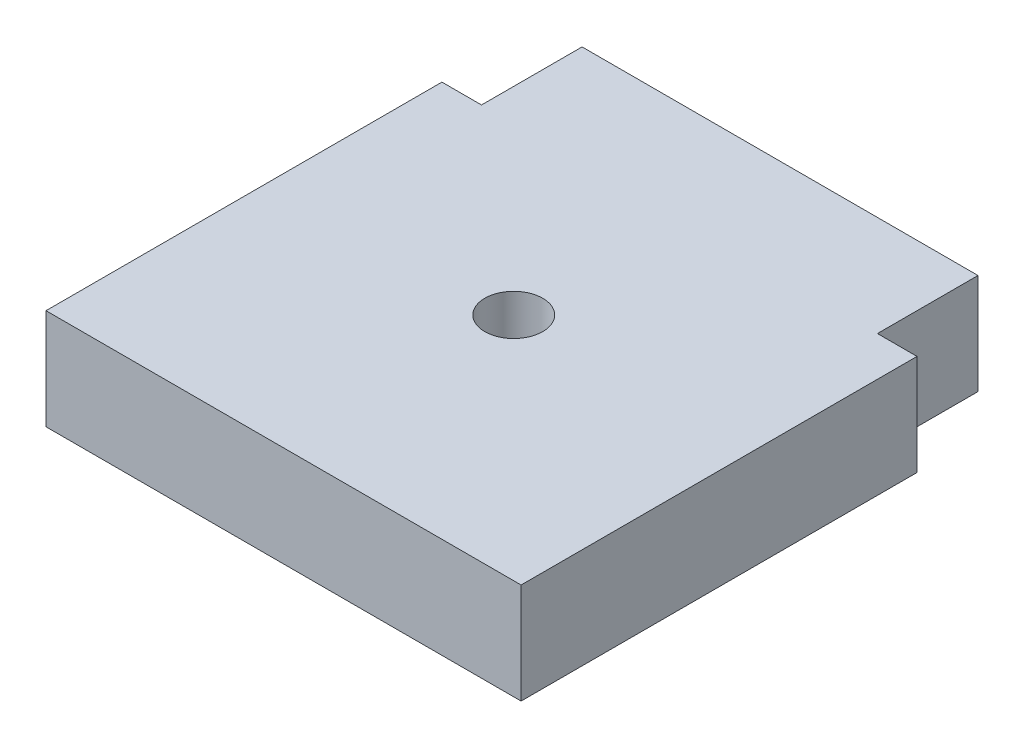
ISO-10303-21;
HEADER;
FILE_DESCRIPTION(('STEP AP214'),'2;1');
FILE_NAME('part.step','',(''),(''),'','','');
FILE_SCHEMA(('AUTOMOTIVE_DESIGN { 1 0 10303 214 1 1 1 1 }'));
ENDSEC;
DATA;
#1=APPLICATION_CONTEXT('core data for automotive mechanical design processes');
#2=APPLICATION_PROTOCOL_DEFINITION('international standard','automotive_design',2000,#1);
#3=PRODUCT_CONTEXT('',#1,'mechanical');
#4=PRODUCT('Part','Part','',(#3));
#5=PRODUCT_RELATED_PRODUCT_CATEGORY('part','',(#4));
#6=PRODUCT_DEFINITION_FORMATION('','',#4);
#7=PRODUCT_DEFINITION_CONTEXT('part definition',#1,'design');
#8=PRODUCT_DEFINITION('design','',#6,#7);
#9=PRODUCT_DEFINITION_SHAPE('','',#8);
#10=(LENGTH_UNIT() NAMED_UNIT(*) SI_UNIT(.MILLI.,.METRE.));
#11=(NAMED_UNIT(*) PLANE_ANGLE_UNIT() SI_UNIT($,.RADIAN.));
#12=(NAMED_UNIT(*) SI_UNIT($,.STERADIAN.) SOLID_ANGLE_UNIT());
#13=UNCERTAINTY_MEASURE_WITH_UNIT(LENGTH_MEASURE(1.E-05),#10,'distance_accuracy_value','');
#14=(GEOMETRIC_REPRESENTATION_CONTEXT(3) GLOBAL_UNCERTAINTY_ASSIGNED_CONTEXT((#13)) GLOBAL_UNIT_ASSIGNED_CONTEXT((#10,
#11,#12)) REPRESENTATION_CONTEXT('',''));
#15=CARTESIAN_POINT('',(0.,0.,0.));
#16=DIRECTION('',(0.,0.,1.));
#17=DIRECTION('',(1.,0.,0.));
#18=AXIS2_PLACEMENT_3D('',#15,#16,#17);
#19=CARTESIAN_POINT('',(-15.,6.35,12.5));
#20=DIRECTION('',(1.,0.,0.));
#21=DIRECTION('',(0.,0.,-1.));
#22=AXIS2_PLACEMENT_3D('',#19,#20,#21);
#23=PLANE('',#22);
#24=DIRECTION('',(0.,0.,1.));
#25=VECTOR('',#24,1.);
#26=CARTESIAN_POINT('',(-15.,0.,12.5));
#27=LINE('',#26,#25);
#28=CARTESIAN_POINT('',(-15.,0.,-12.5));
#29=VERTEX_POINT('',#28);
#30=CARTESIAN_POINT('',(-15.,0.,12.5));
#31=VERTEX_POINT('',#30);
#32=EDGE_CURVE('E129',#29,#31,#27,.T.);
#33=ORIENTED_EDGE('',*,*,#32,.T.);
#34=DIRECTION('',(0.,-1.,0.));
#35=VECTOR('',#34,1.);
#36=CARTESIAN_POINT('',(-15.,6.35,12.5));
#37=LINE('',#36,#35);
#38=CARTESIAN_POINT('',(-15.,6.35,12.5));
#39=VERTEX_POINT('',#38);
#40=EDGE_CURVE('E11',#39,#31,#37,.T.);
#41=ORIENTED_EDGE('',*,*,#40,.F.);
#42=DIRECTION('',(0.,0.,1.));
#43=VECTOR('',#42,1.);
#44=CARTESIAN_POINT('',(-15.,6.35,12.5));
#45=LINE('',#44,#43);
#46=CARTESIAN_POINT('',(-15.,6.35,-12.5));
#47=VERTEX_POINT('',#46);
#48=EDGE_CURVE('E144',#47,#39,#45,.T.);
#49=ORIENTED_EDGE('',*,*,#48,.F.);
#50=DIRECTION('',(0.,-1.,0.));
#51=VECTOR('',#50,1.);
#52=CARTESIAN_POINT('',(-15.,6.35,-12.5));
#53=LINE('',#52,#51);
#54=EDGE_CURVE('E125',#47,#29,#53,.T.);
#55=ORIENTED_EDGE('',*,*,#54,.T.);
#56=EDGE_LOOP('',(#33,#41,#49,#55));
#57=FACE_BOUND('',#56,.T.);
#58=ADVANCED_FACE('F33',(#57),#23,.F.);
#59=CARTESIAN_POINT('',(15.,6.35,12.5));
#60=DIRECTION('',(0.,0.,-1.));
#61=DIRECTION('',(-1.,0.,0.));
#62=AXIS2_PLACEMENT_3D('',#59,#60,#61);
#63=PLANE('',#62);
#64=DIRECTION('',(1.,0.,0.));
#65=VECTOR('',#64,1.);
#66=CARTESIAN_POINT('',(15.,0.,12.5));
#67=LINE('',#66,#65);
#68=CARTESIAN_POINT('',(15.,0.,12.5));
#69=VERTEX_POINT('',#68);
#70=EDGE_CURVE('E132',#31,#69,#67,.T.);
#71=ORIENTED_EDGE('',*,*,#70,.T.);
#72=DIRECTION('',(0.,-1.,0.));
#73=VECTOR('',#72,1.);
#74=CARTESIAN_POINT('',(15.,6.35,12.5));
#75=LINE('',#74,#73);
#76=CARTESIAN_POINT('',(15.,6.35,12.5));
#77=VERTEX_POINT('',#76);
#78=EDGE_CURVE('E41',#77,#69,#75,.T.);
#79=ORIENTED_EDGE('',*,*,#78,.F.);
#80=DIRECTION('',(1.,0.,0.));
#81=VECTOR('',#80,1.);
#82=CARTESIAN_POINT('',(15.,6.35,12.5));
#83=LINE('',#82,#81);
#84=EDGE_CURVE('E92',#39,#77,#83,.T.);
#85=ORIENTED_EDGE('',*,*,#84,.F.);
#86=ORIENTED_EDGE('',*,*,#40,.T.);
#87=EDGE_LOOP('',(#71,#79,#85,#86));
#88=FACE_BOUND('',#87,.T.);
#89=ADVANCED_FACE('F197',(#88),#63,.F.);
#90=CARTESIAN_POINT('',(15.,6.35,12.5));
#91=DIRECTION('',(-1.,0.,0.));
#92=DIRECTION('',(0.,0.,1.));
#93=AXIS2_PLACEMENT_3D('',#90,#91,#92);
#94=PLANE('',#93);
#95=DIRECTION('',(0.,0.,-1.));
#96=VECTOR('',#95,1.);
#97=CARTESIAN_POINT('',(15.,0.,12.5));
#98=LINE('',#97,#96);
#99=CARTESIAN_POINT('',(15.,0.,-12.5));
#100=VERTEX_POINT('',#99);
#101=EDGE_CURVE('E135',#69,#100,#98,.T.);
#102=ORIENTED_EDGE('',*,*,#101,.T.);
#103=DIRECTION('',(0.,-1.,0.));
#104=VECTOR('',#103,1.);
#105=CARTESIAN_POINT('',(15.,6.35,-12.5));
#106=LINE('',#105,#104);
#107=CARTESIAN_POINT('',(15.,6.35,-12.5));
#108=VERTEX_POINT('',#107);
#109=EDGE_CURVE('E151',#108,#100,#106,.T.);
#110=ORIENTED_EDGE('',*,*,#109,.F.);
#111=DIRECTION('',(0.,0.,-1.));
#112=VECTOR('',#111,1.);
#113=CARTESIAN_POINT('',(15.,6.35,12.5));
#114=LINE('',#113,#112);
#115=EDGE_CURVE('E159',#77,#108,#114,.T.);
#116=ORIENTED_EDGE('',*,*,#115,.F.);
#117=ORIENTED_EDGE('',*,*,#78,.T.);
#118=EDGE_LOOP('',(#102,#110,#116,#117));
#119=FACE_BOUND('',#118,.T.);
#120=ADVANCED_FACE('F157',(#119),#94,.F.);
#121=CARTESIAN_POINT('',(15.,6.35,-12.5));
#122=DIRECTION('',(0.,0.,1.));
#123=DIRECTION('',(1.,0.,0.));
#124=AXIS2_PLACEMENT_3D('',#121,#122,#123);
#125=PLANE('',#124);
#126=DIRECTION('',(-1.,0.,0.));
#127=VECTOR('',#126,1.);
#128=CARTESIAN_POINT('',(15.,0.,-12.5));
#129=LINE('',#128,#127);
#130=CARTESIAN_POINT('',(12.5,0.,-12.5));
#131=VERTEX_POINT('',#130);
#132=EDGE_CURVE('E137',#100,#131,#129,.T.);
#133=ORIENTED_EDGE('',*,*,#132,.T.);
#134=DIRECTION('',(0.,-1.,0.));
#135=VECTOR('',#134,1.);
#136=CARTESIAN_POINT('',(12.5,6.35,-12.5));
#137=LINE('',#136,#135);
#138=CARTESIAN_POINT('',(12.5,6.35,-12.5));
#139=VERTEX_POINT('',#138);
#140=EDGE_CURVE('E148',#139,#131,#137,.T.);
#141=ORIENTED_EDGE('',*,*,#140,.F.);
#142=DIRECTION('',(-1.,0.,0.));
#143=VECTOR('',#142,1.);
#144=CARTESIAN_POINT('',(15.,6.35,-12.5));
#145=LINE('',#144,#143);
#146=EDGE_CURVE('E171',#108,#139,#145,.T.);
#147=ORIENTED_EDGE('',*,*,#146,.F.);
#148=ORIENTED_EDGE('',*,*,#109,.T.);
#149=EDGE_LOOP('',(#133,#141,#147,#148));
#150=FACE_BOUND('',#149,.T.);
#151=ADVANCED_FACE('F167',(#150),#125,.F.);
#152=CARTESIAN_POINT('',(12.5,6.35,-18.85));
#153=DIRECTION('',(-1.,0.,0.));
#154=DIRECTION('',(0.,0.,1.));
#155=AXIS2_PLACEMENT_3D('',#152,#153,#154);
#156=PLANE('',#155);
#157=DIRECTION('',(0.,0.,-1.));
#158=VECTOR('',#157,1.);
#159=CARTESIAN_POINT('',(12.5,0.,-18.85));
#160=LINE('',#159,#158);
#161=CARTESIAN_POINT('',(12.5,0.,-18.85));
#162=VERTEX_POINT('',#161);
#163=EDGE_CURVE('E139',#131,#162,#160,.T.);
#164=ORIENTED_EDGE('',*,*,#163,.T.);
#165=DIRECTION('',(0.,-1.,0.));
#166=VECTOR('',#165,1.);
#167=CARTESIAN_POINT('',(12.5,6.35,-18.85));
#168=LINE('',#167,#166);
#169=CARTESIAN_POINT('',(12.5,6.35,-18.85));
#170=VERTEX_POINT('',#169);
#171=EDGE_CURVE('E120',#170,#162,#168,.T.);
#172=ORIENTED_EDGE('',*,*,#171,.F.);
#173=DIRECTION('',(0.,0.,-1.));
#174=VECTOR('',#173,1.);
#175=CARTESIAN_POINT('',(12.5,6.35,-18.85));
#176=LINE('',#175,#174);
#177=EDGE_CURVE('E111',#139,#170,#176,.T.);
#178=ORIENTED_EDGE('',*,*,#177,.F.);
#179=ORIENTED_EDGE('',*,*,#140,.T.);
#180=EDGE_LOOP('',(#164,#172,#178,#179));
#181=FACE_BOUND('',#180,.T.);
#182=ADVANCED_FACE('F170',(#181),#156,.F.);
#183=CARTESIAN_POINT('',(-12.5,6.35,-18.85));
#184=DIRECTION('',(0.,0.,1.));
#185=DIRECTION('',(1.,0.,0.));
#186=AXIS2_PLACEMENT_3D('',#183,#184,#185);
#187=PLANE('',#186);
#188=DIRECTION('',(-1.,0.,0.));
#189=VECTOR('',#188,1.);
#190=CARTESIAN_POINT('',(-12.5,0.,-18.85));
#191=LINE('',#190,#189);
#192=CARTESIAN_POINT('',(-12.5,0.,-18.85));
#193=VERTEX_POINT('',#192);
#194=EDGE_CURVE('E119',#162,#193,#191,.T.);
#195=ORIENTED_EDGE('',*,*,#194,.T.);
#196=DIRECTION('',(0.,-1.,0.));
#197=VECTOR('',#196,1.);
#198=CARTESIAN_POINT('',(-12.5,6.35,-18.85));
#199=LINE('',#198,#197);
#200=CARTESIAN_POINT('',(-12.5,6.35,-18.85));
#201=VERTEX_POINT('',#200);
#202=EDGE_CURVE('E116',#201,#193,#199,.T.);
#203=ORIENTED_EDGE('',*,*,#202,.F.);
#204=DIRECTION('',(-1.,0.,0.));
#205=VECTOR('',#204,1.);
#206=CARTESIAN_POINT('',(-12.5,6.35,-18.85));
#207=LINE('',#206,#205);
#208=EDGE_CURVE('E105',#170,#201,#207,.T.);
#209=ORIENTED_EDGE('',*,*,#208,.F.);
#210=ORIENTED_EDGE('',*,*,#171,.T.);
#211=EDGE_LOOP('',(#195,#203,#209,#210));
#212=FACE_BOUND('',#211,.T.);
#213=ADVANCED_FACE('F117',(#212),#187,.F.);
#214=CARTESIAN_POINT('',(-12.5,6.35,-18.85));
#215=DIRECTION('',(1.,0.,0.));
#216=DIRECTION('',(0.,0.,-1.));
#217=AXIS2_PLACEMENT_3D('',#214,#215,#216);
#218=PLANE('',#217);
#219=DIRECTION('',(0.,0.,1.));
#220=VECTOR('',#219,1.);
#221=CARTESIAN_POINT('',(-12.5,0.,-18.85));
#222=LINE('',#221,#220);
#223=CARTESIAN_POINT('',(-12.5,0.,-12.5));
#224=VERTEX_POINT('',#223);
#225=EDGE_CURVE('E78',#193,#224,#222,.T.);
#226=ORIENTED_EDGE('',*,*,#225,.T.);
#227=DIRECTION('',(0.,-1.,0.));
#228=VECTOR('',#227,1.);
#229=CARTESIAN_POINT('',(-12.5,6.35,-12.5));
#230=LINE('',#229,#228);
#231=CARTESIAN_POINT('',(-12.5,6.35,-12.5));
#232=VERTEX_POINT('',#231);
#233=EDGE_CURVE('E121',#232,#224,#230,.T.);
#234=ORIENTED_EDGE('',*,*,#233,.F.);
#235=DIRECTION('',(0.,0.,1.));
#236=VECTOR('',#235,1.);
#237=CARTESIAN_POINT('',(-12.5,6.35,-18.85));
#238=LINE('',#237,#236);
#239=EDGE_CURVE('E109',#201,#232,#238,.T.);
#240=ORIENTED_EDGE('',*,*,#239,.F.);
#241=ORIENTED_EDGE('',*,*,#202,.T.);
#242=EDGE_LOOP('',(#226,#234,#240,#241));
#243=FACE_BOUND('',#242,.T.);
#244=ADVANCED_FACE('F123',(#243),#218,.F.);
#245=CARTESIAN_POINT('',(-12.5,6.35,-12.5));
#246=DIRECTION('',(0.,0.,1.));
#247=DIRECTION('',(1.,0.,0.));
#248=AXIS2_PLACEMENT_3D('',#245,#246,#247);
#249=PLANE('',#248);
#250=DIRECTION('',(-1.,0.,0.));
#251=VECTOR('',#250,1.);
#252=CARTESIAN_POINT('',(-12.5,0.,-12.5));
#253=LINE('',#252,#251);
#254=EDGE_CURVE('E84',#224,#29,#253,.T.);
#255=ORIENTED_EDGE('',*,*,#254,.T.);
#256=ORIENTED_EDGE('',*,*,#54,.F.);
#257=DIRECTION('',(-1.,0.,0.));
#258=VECTOR('',#257,1.);
#259=CARTESIAN_POINT('',(-12.5,6.35,-12.5));
#260=LINE('',#259,#258);
#261=EDGE_CURVE('E49',#232,#47,#260,.T.);
#262=ORIENTED_EDGE('',*,*,#261,.F.);
#263=ORIENTED_EDGE('',*,*,#233,.T.);
#264=EDGE_LOOP('',(#255,#256,#262,#263));
#265=FACE_BOUND('',#264,.T.);
#266=ADVANCED_FACE('F186',(#265),#249,.F.);
#267=CARTESIAN_POINT('',(0.,6.35,0.));
#268=DIRECTION('',(0.,1.,0.));
#269=DIRECTION('',(0.,0.,1.));
#270=AXIS2_PLACEMENT_3D('',#267,#268,#269);
#271=PLANE('',#270);
#272=CARTESIAN_POINT('',(0.,6.35,-2.0352));
#273=DIRECTION('',(0.,1.,0.));
#274=DIRECTION('',(0.,0.,1.));
#275=AXIS2_PLACEMENT_3D('',#272,#273,#274);
#276=CIRCLE('',#275,1.82879999999999);
#277=CARTESIAN_POINT('',(0.,6.35,-0.206400000000011));
#278=VERTEX_POINT('',#277);
#279=EDGE_CURVE('E179',#278,#278,#276,.T.);
#280=ORIENTED_EDGE('',*,*,#279,.F.);
#281=EDGE_LOOP('',(#280));
#282=FACE_BOUND('',#281,.T.);
#283=ORIENTED_EDGE('',*,*,#48,.T.);
#284=ORIENTED_EDGE('',*,*,#84,.T.);
#285=ORIENTED_EDGE('',*,*,#115,.T.);
#286=ORIENTED_EDGE('',*,*,#146,.T.);
#287=ORIENTED_EDGE('',*,*,#177,.T.);
#288=ORIENTED_EDGE('',*,*,#208,.T.);
#289=ORIENTED_EDGE('',*,*,#239,.T.);
#290=ORIENTED_EDGE('',*,*,#261,.T.);
#291=EDGE_LOOP('',(#283,#284,#285,#286,#287,#288,#289,#290));
#292=FACE_BOUND('',#291,.T.);
#293=ADVANCED_FACE('F107',(#282,#292),#271,.T.);
#294=CARTESIAN_POINT('',(0.,0.,0.));
#295=DIRECTION('',(0.,1.,0.));
#296=DIRECTION('',(0.,0.,1.));
#297=AXIS2_PLACEMENT_3D('',#294,#295,#296);
#298=PLANE('',#297);
#299=CARTESIAN_POINT('',(0.,0.,-2.0352));
#300=DIRECTION('',(0.,1.,0.));
#301=DIRECTION('',(0.,0.,1.));
#302=AXIS2_PLACEMENT_3D('',#299,#300,#301);
#303=CIRCLE('',#302,1.8288);
#304=CARTESIAN_POINT('',(0.,0.,-0.2064));
#305=VERTEX_POINT('',#304);
#306=EDGE_CURVE('E133',#305,#305,#303,.T.);
#307=ORIENTED_EDGE('',*,*,#306,.T.);
#308=EDGE_LOOP('',(#307));
#309=FACE_BOUND('',#308,.T.);
#310=ORIENTED_EDGE('',*,*,#32,.F.);
#311=ORIENTED_EDGE('',*,*,#254,.F.);
#312=ORIENTED_EDGE('',*,*,#225,.F.);
#313=ORIENTED_EDGE('',*,*,#194,.F.);
#314=ORIENTED_EDGE('',*,*,#163,.F.);
#315=ORIENTED_EDGE('',*,*,#132,.F.);
#316=ORIENTED_EDGE('',*,*,#101,.F.);
#317=ORIENTED_EDGE('',*,*,#70,.F.);
#318=EDGE_LOOP('',(#310,#311,#312,#313,#314,#315,#316,#317));
#319=FACE_BOUND('',#318,.T.);
#320=ADVANCED_FACE('F163',(#309,#319),#298,.F.);
#321=CARTESIAN_POINT('',(0.,6.35,-2.0352));
#322=DIRECTION('',(0.,1.,0.));
#323=DIRECTION('',(0.,0.,1.));
#324=AXIS2_PLACEMENT_3D('',#321,#322,#323);
#325=CYLINDRICAL_SURFACE('',#324,1.82879999999999);
#326=ORIENTED_EDGE('',*,*,#306,.F.);
#327=EDGE_LOOP('',(#326));
#328=FACE_BOUND('',#327,.T.);
#329=ORIENTED_EDGE('',*,*,#279,.T.);
#330=EDGE_LOOP('',(#329));
#331=FACE_BOUND('',#330,.T.);
#332=ADVANCED_FACE('F183',(#328,#331),#325,.F.);
#333=CLOSED_SHELL('',(#58,#89,#120,#151,#182,#213,#244,#266,#293,#320,#332));
#334=MANIFOLD_SOLID_BREP('B2',#333);
#335=ADVANCED_BREP_SHAPE_REPRESENTATION('',(#18,#334),#14);
#336=SHAPE_DEFINITION_REPRESENTATION(#9,#335);
ENDSEC;
END-ISO-10303-21;
